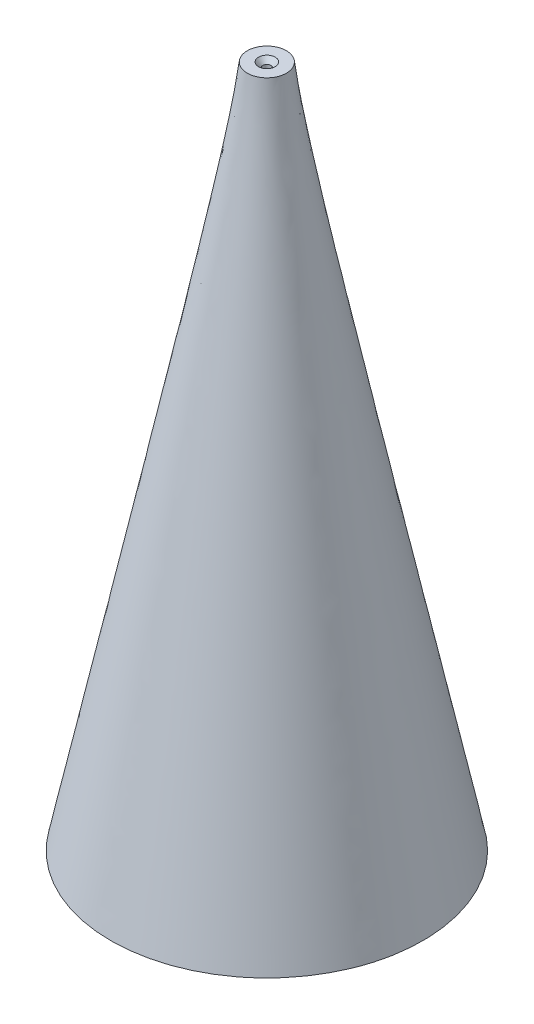
ISO-10303-21;
HEADER;
FILE_DESCRIPTION(('STEP AP214'),'2;1');
FILE_NAME('part.step','',(''),(''),'','','');
FILE_SCHEMA(('AUTOMOTIVE_DESIGN { 1 0 10303 214 1 1 1 1 }'));
ENDSEC;
DATA;
#1=APPLICATION_CONTEXT('core data for automotive mechanical design processes');
#2=APPLICATION_PROTOCOL_DEFINITION('international standard','automotive_design',2000,#1);
#3=PRODUCT_CONTEXT('',#1,'mechanical');
#4=PRODUCT('Part','Part','',(#3));
#5=PRODUCT_RELATED_PRODUCT_CATEGORY('part','',(#4));
#6=PRODUCT_DEFINITION_FORMATION('','',#4);
#7=PRODUCT_DEFINITION_CONTEXT('part definition',#1,'design');
#8=PRODUCT_DEFINITION('design','',#6,#7);
#9=PRODUCT_DEFINITION_SHAPE('','',#8);
#10=(LENGTH_UNIT() NAMED_UNIT(*) SI_UNIT(.MILLI.,.METRE.));
#11=(NAMED_UNIT(*) PLANE_ANGLE_UNIT() SI_UNIT($,.RADIAN.));
#12=(NAMED_UNIT(*) SI_UNIT($,.STERADIAN.) SOLID_ANGLE_UNIT());
#13=UNCERTAINTY_MEASURE_WITH_UNIT(LENGTH_MEASURE(1.E-05),#10,'distance_accuracy_value','');
#14=(GEOMETRIC_REPRESENTATION_CONTEXT(3) GLOBAL_UNCERTAINTY_ASSIGNED_CONTEXT((#13)) GLOBAL_UNIT_ASSIGNED_CONTEXT((#10,
#11,#12)) REPRESENTATION_CONTEXT('',''));
#15=CARTESIAN_POINT('',(0.,0.,0.));
#16=DIRECTION('',(0.,0.,1.));
#17=DIRECTION('',(1.,0.,0.));
#18=AXIS2_PLACEMENT_3D('',#15,#16,#17);
#19=CARTESIAN_POINT('',(0.,175.,0.));
#20=DIRECTION('',(0.,1.,0.));
#21=DIRECTION('',(0.,0.,1.));
#22=AXIS2_PLACEMENT_3D('',#19,#20,#21);
#23=PLANE('',#22);
#24=CARTESIAN_POINT('',(0.,175.,0.));
#25=DIRECTION('',(0.,1.,0.));
#26=DIRECTION('',(0.,0.,1.));
#27=AXIS2_PLACEMENT_3D('',#24,#25,#26);
#28=CIRCLE('',#27,2.1336);
#29=CARTESIAN_POINT('',(0.,175.,2.1336));
#30=VERTEX_POINT('',#29);
#31=EDGE_CURVE('E123',#30,#30,#28,.T.);
#32=ORIENTED_EDGE('',*,*,#31,.F.);
#33=EDGE_LOOP('',(#32));
#34=FACE_BOUND('',#33,.T.);
#35=CARTESIAN_POINT('',(0.,175.,0.));
#36=DIRECTION('',(0.,1.,0.));
#37=DIRECTION('',(0.,0.,1.));
#38=AXIS2_PLACEMENT_3D('',#35,#36,#37);
#39=CIRCLE('',#38,5.);
#40=CARTESIAN_POINT('',(-4.76298891912236,175.,1.52116289604949));
#41=VERTEX_POINT('',#40);
#42=EDGE_CURVE('E11',#41,#41,#39,.T.);
#43=ORIENTED_EDGE('',*,*,#42,.T.);
#44=EDGE_LOOP('',(#43));
#45=FACE_BOUND('',#44,.T.);
#46=ADVANCED_FACE('F44',(#34,#45),#23,.T.);
#47=CARTESIAN_POINT('',(0.,0.,0.));
#48=DIRECTION('',(0.,1.,0.));
#49=DIRECTION('',(0.,0.,1.));
#50=AXIS2_PLACEMENT_3D('',#47,#48,#49);
#51=PLANE('',#50);
#52=CARTESIAN_POINT('',(0.,0.,0.));
#53=DIRECTION('',(0.,1.,0.));
#54=DIRECTION('',(0.,0.,1.));
#55=AXIS2_PLACEMENT_3D('',#52,#53,#54);
#56=CIRCLE('',#55,1.02869999999999);
#57=CARTESIAN_POINT('',(0.,0.,1.02869999999999));
#58=VERTEX_POINT('',#57);
#59=EDGE_CURVE('E48',#58,#58,#56,.T.);
#60=ORIENTED_EDGE('',*,*,#59,.T.);
#61=EDGE_LOOP('',(#60));
#62=FACE_BOUND('',#61,.T.);
#63=CARTESIAN_POINT('',(0.,0.,0.));
#64=DIRECTION('',(0.,1.,0.));
#65=DIRECTION('',(0.,0.,1.));
#66=AXIS2_PLACEMENT_3D('',#63,#64,#65);
#67=CIRCLE('',#66,40.);
#68=CARTESIAN_POINT('',(-34.1187316623424,0.,-20.8785092799528));
#69=VERTEX_POINT('',#68);
#70=EDGE_CURVE('E52',#69,#69,#67,.T.);
#71=ORIENTED_EDGE('',*,*,#70,.F.);
#72=EDGE_LOOP('',(#71));
#73=FACE_BOUND('',#72,.T.);
#74=ADVANCED_FACE('F77',(#62,#73),#51,.F.);
#75=CARTESIAN_POINT('',(-34.1187316623424,0.,-20.8785092799528));
#76=CARTESIAN_POINT('',(-4.76298891912236,175.,1.52116289604949));
#77=CARTESIAN_POINT('',(-75.875750222248,0.,47.3589540447318));
#78=CARTESIAN_POINT('',(-1.72066312702338,175.,11.0471407342942));
#79=CARTESIAN_POINT('',(-7.63828689756331,0.,89.1159726046375));
#80=CARTESIAN_POINT('',(7.80531471122132,175.,8.00481494219522));
#81=CARTESIAN_POINT('',(34.1187316623424,0.,20.8785092799529));
#82=CARTESIAN_POINT('',(4.76298891912236,175.,-1.52116289604948));
#83=CARTESIAN_POINT('',(75.8757502222481,0.,-47.3589540447318));
#84=CARTESIAN_POINT('',(1.72066312702339,175.,-11.0471407342942));
#85=CARTESIAN_POINT('',(7.63828689756336,0.,-89.1159726046375));
#86=CARTESIAN_POINT('',(-7.80531471122132,175.,-8.00481494219522));
#87=CARTESIAN_POINT('',(-34.1187316623424,0.,-20.8785092799528));
#88=CARTESIAN_POINT('',(-4.76298891912236,175.,1.52116289604949));
#89=(BOUNDED_SURFACE() B_SPLINE_SURFACE(3,1,((#75,#76),(#77,#78),(#79,#80),(#81,#82),(#83,#84),
(#85,#86),(#87,#88)),.UNSPECIFIED.,.T.,.F.,.F.) B_SPLINE_SURFACE_WITH_KNOTS((4,3,4),(2,2),(0.,
0.5,1.),(0.,1.),.UNSPECIFIED.) GEOMETRIC_REPRESENTATION_ITEM() RATIONAL_B_SPLINE_SURFACE(((1.,
1.),(0.333333333333334,0.333333333333334),(0.333333333333334,0.333333333333334),(1.,1.),
(0.333333333333333,0.333333333333333),(0.333333333333333,0.333333333333333),(1.,1.))) REPRESENTATION_ITEM('') SURFACE());
#90=CARTESIAN_POINT('',(-34.1187316623424,0.,-20.8785092799528));
#91=CARTESIAN_POINT('',(-33.8129426754338,1.82291666666667,-20.6451793614528));
#92=CARTESIAN_POINT('',(-33.5071536885253,3.64583333333333,-20.4118494429528));
#93=CARTESIAN_POINT('',(-32.8955757147082,7.29166666666667,-19.9451896059527));
#94=CARTESIAN_POINT('',(-32.5897867277997,9.11458333333333,-19.7118596874527));
#95=CARTESIAN_POINT('',(-31.9782087539826,12.7604166666667,-19.2451998504527));
#96=CARTESIAN_POINT('',(-31.672419767074,14.5833333333333,-19.0118699319526));
#97=CARTESIAN_POINT('',(-31.060841793257,18.2291666666667,-18.5452100949526));
#98=CARTESIAN_POINT('',(-30.7550528063484,20.0520833333333,-18.3118801764526));
#99=CARTESIAN_POINT('',(-30.1434748325313,23.6979166666667,-17.8452203394525));
#100=CARTESIAN_POINT('',(-29.8376858456228,25.5208333333333,-17.6118904209525));
#101=CARTESIAN_POINT('',(-29.2261078718057,29.1666666666667,-17.1452305839524));
#102=CARTESIAN_POINT('',(-28.9203188848972,30.9895833333333,-16.9119006654524));
#103=CARTESIAN_POINT('',(-28.3087409110801,34.6354166666667,-16.4452408284524));
#104=CARTESIAN_POINT('',(-28.0029519241715,36.4583333333333,-16.2119109099523));
#105=CARTESIAN_POINT('',(-27.3913739503544,40.1041666666667,-15.7452510729523));
#106=CARTESIAN_POINT('',(-27.0855849634459,41.9270833333333,-15.5119211544523));
#107=CARTESIAN_POINT('',(-26.4740069896288,45.5729166666667,-15.0452613174522));
#108=CARTESIAN_POINT('',(-26.1682180027203,47.3958333333333,-14.8119313989522));
#109=CARTESIAN_POINT('',(-25.5566400289032,51.0416666666667,-14.3452715619522));
#110=CARTESIAN_POINT('',(-25.2508510419947,52.8645833333333,-14.1119416434521));
#111=CARTESIAN_POINT('',(-24.6392730681776,56.5104166666667,-13.6452818064521));
#112=CARTESIAN_POINT('',(-24.333484081269,58.3333333333333,-13.4119518879521));
#113=CARTESIAN_POINT('',(-23.7219061074519,61.9791666666667,-12.945292050952));
#114=CARTESIAN_POINT('',(-23.4161171205434,63.8020833333333,-12.711962132452));
#115=CARTESIAN_POINT('',(-22.8045391467263,67.4479166666667,-12.2453022954519));
#116=CARTESIAN_POINT('',(-22.4987501598178,69.2708333333333,-12.0119723769519));
#117=CARTESIAN_POINT('',(-21.8871721860007,72.9166666666667,-11.5453125399519));
#118=CARTESIAN_POINT('',(-21.5813831990922,74.7395833333333,-11.3119826214518));
#119=CARTESIAN_POINT('',(-20.9698052252751,78.3854166666667,-10.8453227844518));
#120=CARTESIAN_POINT('',(-20.6640162383665,80.2083333333333,-10.6119928659518));
#121=CARTESIAN_POINT('',(-20.0524382645494,83.8541666666667,-10.1453330289517));
#122=CARTESIAN_POINT('',(-19.7466492776409,85.6770833333333,-9.91200311045169));
#123=CARTESIAN_POINT('',(-19.1350713038238,89.3229166666667,-9.44534327345165));
#124=CARTESIAN_POINT('',(-18.8292823169153,91.1458333333333,-9.21201335495162));
#125=CARTESIAN_POINT('',(-18.2177043430982,94.7916666666667,-8.74535351795157));
#126=CARTESIAN_POINT('',(-17.9119153561897,96.6145833333333,-8.51202359945155));
#127=CARTESIAN_POINT('',(-17.3003373823726,100.260416666667,-8.0453637624515));
#128=CARTESIAN_POINT('',(-16.994548395464,102.083333333333,-7.81203384395148));
#129=CARTESIAN_POINT('',(-16.3829704216469,105.729166666667,-7.34537400695143));
#130=CARTESIAN_POINT('',(-16.0771814347384,107.552083333333,-7.1120440884514));
#131=CARTESIAN_POINT('',(-15.4656034609213,111.197916666667,-6.64538425145136));
#132=CARTESIAN_POINT('',(-15.1598144740128,113.020833333333,-6.41205433295133));
#133=CARTESIAN_POINT('',(-14.5482365001957,116.666666666667,-5.94539449595128));
#134=CARTESIAN_POINT('',(-14.2424475132871,118.489583333333,-5.71206457745126));
#135=CARTESIAN_POINT('',(-13.6308695394701,122.135416666667,-5.24540474045121));
#136=CARTESIAN_POINT('',(-13.3250805525615,123.958333333333,-5.01207482195119));
#137=CARTESIAN_POINT('',(-12.7135025787444,127.604166666667,-4.54541498495114));
#138=CARTESIAN_POINT('',(-12.4077135918359,129.427083333333,-4.31208506645111));
#139=CARTESIAN_POINT('',(-11.7961356180188,133.072916666667,-3.84542522945107));
#140=CARTESIAN_POINT('',(-11.4903466311103,134.895833333333,-3.61209531095104));
#141=CARTESIAN_POINT('',(-10.8787686572932,138.541666666667,-3.14543547395099));
#142=CARTESIAN_POINT('',(-10.5729796703847,140.364583333333,-2.91210555545097));
#143=CARTESIAN_POINT('',(-9.96140169656756,144.010416666667,-2.44544571845092));
#144=CARTESIAN_POINT('',(-9.65561270965902,145.833333333333,-2.2121157999509));
#145=CARTESIAN_POINT('',(-9.04403473584194,149.479166666667,-1.74545596295085));
#146=CARTESIAN_POINT('',(-8.7382457489334,151.302083333333,-1.51212604445083));
#147=CARTESIAN_POINT('',(-8.12666777511631,154.947916666667,-1.04546620745078));
#148=CARTESIAN_POINT('',(-7.82087878820777,156.770833333333,-0.812136288950752));
#149=CARTESIAN_POINT('',(-7.20930081439069,160.416666666667,-0.345476451950704));
#150=CARTESIAN_POINT('',(-6.90351182748215,162.239583333333,-0.112146533450681));
#151=CARTESIAN_POINT('',(-6.29193385366507,165.885416666667,0.354513303549367));
#152=CARTESIAN_POINT('',(-5.98614486675652,167.708333333333,0.587843222049391));
#153=CARTESIAN_POINT('',(-5.37456689293944,171.354166666667,1.05450305904944));
#154=CARTESIAN_POINT('',(-5.0687779060309,173.177083333333,1.28783297754946));
#155=CARTESIAN_POINT('',(-4.76298891912236,175.,1.52116289604949));
#156=B_SPLINE_CURVE_WITH_KNOTS('',3,(#90,#91,#92,#93,#94,#95,#96,#97,#98,#99,#100,#101,#102,
#103,#104,#105,#106,#107,#108,#109,#110,#111,#112,#113,#114,#115,#116,#117,#118,#119,#120,#121,
#122,#123,#124,#125,#126,#127,#128,#129,#130,#131,#132,#133,#134,#135,#136,#137,#138,#139,#140,
#141,#142,#143,#144,#145,#146,#147,#148,#149,#150,#151,#152,#153,#154,#155),.UNSPECIFIED.,.F.,
.F.,(4,2,2,2,2,2,2,2,2,2,2,2,2,2,2,2,2,2,2,2,2,2,2,2,2,2,2,2,2,2,2,2,4),(0.,5.58916580188278,
11.1783316037656,16.7674974056483,22.3566632075311,27.9458290094139,33.5349948112967,
39.1241606131795,44.7133264150623,50.302492216945,55.8916580188278,61.4808238207106,
67.0699896225934,72.6591554244762,78.248321226359,83.8374870282417,89.4266528301245,
95.0158186320073,100.60498443389,106.194150235773,111.783316037656,117.372481839538,
122.961647641421,128.550813443304,134.139979245187,139.72914504707,145.318310848952,
150.907476650835,156.496642452718,162.085808254601,167.674974056484,173.264139858366,
178.853305660249),.UNSPECIFIED.);
#157=EDGE_CURVE('BSEAM86',#69,#41,#156,.T.);
#158=ORIENTED_EDGE('',*,*,#70,.T.);
#159=ORIENTED_EDGE('',*,*,#42,.F.);
#160=ORIENTED_EDGE('',*,*,#157,.T.);
#161=ORIENTED_EDGE('',*,*,#157,.F.);
#162=EDGE_LOOP('',(#158,#160,#159,#161));
#163=FACE_BOUND('',#162,.T.);
#164=ADVANCED_FACE('F86',(#163),#89,.T.);
#165=CARTESIAN_POINT('',(0.,175.,0.));
#166=DIRECTION('',(0.,1.,0.));
#167=DIRECTION('',(0.,0.,1.));
#168=AXIS2_PLACEMENT_3D('',#165,#166,#167);
#169=CYLINDRICAL_SURFACE('',#168,1.02869999999999);
#170=CARTESIAN_POINT('',(0.,173.728957946861,0.));
#171=DIRECTION('',(0.,1.,0.));
#172=DIRECTION('',(0.,0.,1.));
#173=AXIS2_PLACEMENT_3D('',#170,#171,#172);
#174=CIRCLE('',#173,1.02869999999999);
#175=CARTESIAN_POINT('',(0.,173.728957946861,1.02869999999999));
#176=VERTEX_POINT('',#175);
#177=EDGE_CURVE('E120',#176,#176,#174,.T.);
#178=ORIENTED_EDGE('',*,*,#177,.T.);
#179=EDGE_LOOP('',(#178));
#180=FACE_BOUND('',#179,.T.);
#181=ORIENTED_EDGE('',*,*,#59,.F.);
#182=EDGE_LOOP('',(#181));
#183=FACE_BOUND('',#182,.T.);
#184=ADVANCED_FACE('F88',(#180,#183),#169,.F.);
#185=CARTESIAN_POINT('',(0.,175.,0.));
#186=DIRECTION('',(0.,1.,0.));
#187=DIRECTION('',(0.,0.,1.));
#188=AXIS2_PLACEMENT_3D('',#185,#186,#187);
#189=CONICAL_SURFACE('',#188,2.1336,0.71558499331768);
#190=ORIENTED_EDGE('',*,*,#177,.F.);
#191=EDGE_LOOP('',(#190));
#192=FACE_BOUND('',#191,.T.);
#193=ORIENTED_EDGE('',*,*,#31,.T.);
#194=EDGE_LOOP('',(#193));
#195=FACE_BOUND('',#194,.T.);
#196=ADVANCED_FACE('F127',(#192,#195),#189,.F.);
#197=CLOSED_SHELL('',(#46,#74,#164,#184,#196));
#198=MANIFOLD_SOLID_BREP('B2',#197);
#199=ADVANCED_BREP_SHAPE_REPRESENTATION('',(#18,#198),#14);
#200=SHAPE_DEFINITION_REPRESENTATION(#9,#199);
ENDSEC;
END-ISO-10303-21;
